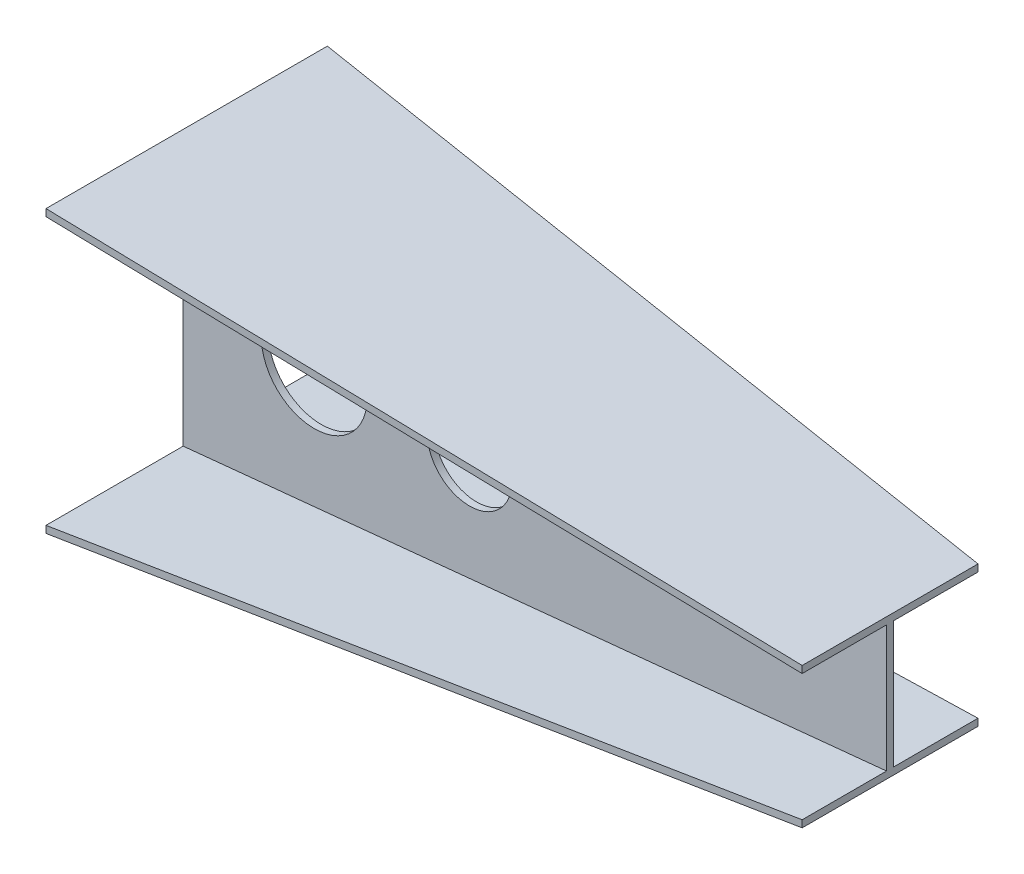
ISO-10303-21;
HEADER;
FILE_DESCRIPTION(('STEP AP214'),'2;1');
FILE_NAME('part.step','',(''),(''),'','','');
FILE_SCHEMA(('AUTOMOTIVE_DESIGN { 1 0 10303 214 1 1 1 1 }'));
ENDSEC;
DATA;
#1=APPLICATION_CONTEXT('core data for automotive mechanical design processes');
#2=APPLICATION_PROTOCOL_DEFINITION('international standard','automotive_design',2000,#1);
#3=PRODUCT_CONTEXT('',#1,'mechanical');
#4=PRODUCT('Part','Part','',(#3));
#5=PRODUCT_RELATED_PRODUCT_CATEGORY('part','',(#4));
#6=PRODUCT_DEFINITION_FORMATION('','',#4);
#7=PRODUCT_DEFINITION_CONTEXT('part definition',#1,'design');
#8=PRODUCT_DEFINITION('design','',#6,#7);
#9=PRODUCT_DEFINITION_SHAPE('','',#8);
#10=(LENGTH_UNIT() NAMED_UNIT(*) SI_UNIT(.MILLI.,.METRE.));
#11=(NAMED_UNIT(*) PLANE_ANGLE_UNIT() SI_UNIT($,.RADIAN.));
#12=(NAMED_UNIT(*) SI_UNIT($,.STERADIAN.) SOLID_ANGLE_UNIT());
#13=UNCERTAINTY_MEASURE_WITH_UNIT(LENGTH_MEASURE(1.E-05),#10,'distance_accuracy_value','');
#14=(GEOMETRIC_REPRESENTATION_CONTEXT(3) GLOBAL_UNCERTAINTY_ASSIGNED_CONTEXT((#13)) GLOBAL_UNIT_ASSIGNED_CONTEXT((#10,
#11,#12)) REPRESENTATION_CONTEXT('',''));
#15=CARTESIAN_POINT('',(0.,0.,0.));
#16=DIRECTION('',(0.,0.,1.));
#17=DIRECTION('',(1.,0.,0.));
#18=AXIS2_PLACEMENT_3D('',#15,#16,#17);
#19=CARTESIAN_POINT('',(1000.,0.,0.));
#20=DIRECTION('',(-1.,0.,0.));
#21=DIRECTION('',(0.,0.,1.));
#22=AXIS2_PLACEMENT_3D('',#19,#20,#21);
#23=PLANE('',#22);
#24=DIRECTION('',(0.,-1.,0.));
#25=VECTOR('',#24,1.);
#26=CARTESIAN_POINT('',(1000.,100.,-120.));
#27=LINE('',#26,#25);
#28=CARTESIAN_POINT('',(1000.,100.,-120.));
#29=VERTEX_POINT('',#28);
#30=CARTESIAN_POINT('',(1000.,90.,-120.));
#31=VERTEX_POINT('',#30);
#32=EDGE_CURVE('E384',#29,#31,#27,.T.);
#33=ORIENTED_EDGE('',*,*,#32,.F.);
#34=DIRECTION('',(0.,0.,-1.));
#35=VECTOR('',#34,1.);
#36=CARTESIAN_POINT('',(1000.,100.,-120.));
#37=LINE('',#36,#35);
#38=CARTESIAN_POINT('',(1000.,100.,130.));
#39=VERTEX_POINT('',#38);
#40=EDGE_CURVE('E12',#39,#29,#37,.T.);
#41=ORIENTED_EDGE('',*,*,#40,.F.);
#42=DIRECTION('',(0.,1.,0.));
#43=VECTOR('',#42,1.);
#44=CARTESIAN_POINT('',(1000.,100.,130.));
#45=LINE('',#44,#43);
#46=CARTESIAN_POINT('',(1000.,90.,130.));
#47=VERTEX_POINT('',#46);
#48=EDGE_CURVE('E73',#47,#39,#45,.T.);
#49=ORIENTED_EDGE('',*,*,#48,.F.);
#50=DIRECTION('',(0.,0.,1.));
#51=VECTOR('',#50,1.);
#52=CARTESIAN_POINT('',(1000.,90.,10.));
#53=LINE('',#52,#51);
#54=CARTESIAN_POINT('',(1000.,90.,10.));
#55=VERTEX_POINT('',#54);
#56=EDGE_CURVE('E660',#55,#47,#53,.T.);
#57=ORIENTED_EDGE('',*,*,#56,.F.);
#58=DIRECTION('',(0.,1.,0.));
#59=VECTOR('',#58,1.);
#60=CARTESIAN_POINT('',(1000.,90.,10.));
#61=LINE('',#60,#59);
#62=CARTESIAN_POINT('',(1000.,-90.,10.));
#63=VERTEX_POINT('',#62);
#64=EDGE_CURVE('E421',#63,#55,#61,.T.);
#65=ORIENTED_EDGE('',*,*,#64,.F.);
#66=DIRECTION('',(0.,0.,-1.));
#67=VECTOR('',#66,1.);
#68=CARTESIAN_POINT('',(1000.,-90.,10.));
#69=LINE('',#68,#67);
#70=CARTESIAN_POINT('',(1000.,-90.,130.));
#71=VERTEX_POINT('',#70);
#72=EDGE_CURVE('E435',#71,#63,#69,.T.);
#73=ORIENTED_EDGE('',*,*,#72,.F.);
#74=DIRECTION('',(0.,1.,0.));
#75=VECTOR('',#74,1.);
#76=CARTESIAN_POINT('',(1000.,-90.,130.));
#77=LINE('',#76,#75);
#78=CARTESIAN_POINT('',(1000.,-100.,130.));
#79=VERTEX_POINT('',#78);
#80=EDGE_CURVE('E449',#79,#71,#77,.T.);
#81=ORIENTED_EDGE('',*,*,#80,.F.);
#82=DIRECTION('',(0.,0.,1.));
#83=VECTOR('',#82,1.);
#84=CARTESIAN_POINT('',(1000.,-100.,-120.));
#85=LINE('',#84,#83);
#86=CARTESIAN_POINT('',(1000.,-100.,-120.));
#87=VERTEX_POINT('',#86);
#88=EDGE_CURVE('E631',#87,#79,#85,.T.);
#89=ORIENTED_EDGE('',*,*,#88,.F.);
#90=DIRECTION('',(0.,-1.,0.));
#91=VECTOR('',#90,1.);
#92=CARTESIAN_POINT('',(1000.,-90.,-120.));
#93=LINE('',#92,#91);
#94=CARTESIAN_POINT('',(1000.,-90.,-120.));
#95=VERTEX_POINT('',#94);
#96=EDGE_CURVE('E623',#95,#87,#93,.T.);
#97=ORIENTED_EDGE('',*,*,#96,.F.);
#98=DIRECTION('',(0.,0.,-1.));
#99=VECTOR('',#98,1.);
#100=CARTESIAN_POINT('',(1000.,-90.,-120.));
#101=LINE('',#100,#99);
#102=CARTESIAN_POINT('',(1000.,-90.,2.22044604925031E-13));
#103=VERTEX_POINT('',#102);
#104=EDGE_CURVE('E537',#103,#95,#101,.T.);
#105=ORIENTED_EDGE('',*,*,#104,.F.);
#106=DIRECTION('',(0.,-1.,0.));
#107=VECTOR('',#106,1.);
#108=CARTESIAN_POINT('',(1000.,90.,2.22044604925031E-13));
#109=LINE('',#108,#107);
#110=CARTESIAN_POINT('',(1000.,90.,2.22044604925031E-13));
#111=VERTEX_POINT('',#110);
#112=EDGE_CURVE('E87',#111,#103,#109,.T.);
#113=ORIENTED_EDGE('',*,*,#112,.F.);
#114=DIRECTION('',(0.,0.,1.));
#115=VECTOR('',#114,1.);
#116=CARTESIAN_POINT('',(1000.,90.,-120.));
#117=LINE('',#116,#115);
#118=EDGE_CURVE('E81',#31,#111,#117,.T.);
#119=ORIENTED_EDGE('',*,*,#118,.F.);
#120=EDGE_LOOP('',(#33,#41,#49,#57,#65,#73,#81,#89,#97,#105,#113,#119));
#121=FACE_BOUND('',#120,.T.);
#122=ADVANCED_FACE('F63',(#121),#23,.F.);
#123=CARTESIAN_POINT('',(0.,0.,0.));
#124=DIRECTION('',(1.,0.,0.));
#125=DIRECTION('',(0.,0.,-1.));
#126=AXIS2_PLACEMENT_3D('',#123,#124,#125);
#127=PLANE('',#126);
#128=DIRECTION('',(0.,-1.,0.));
#129=VECTOR('',#128,1.);
#130=CARTESIAN_POINT('',(0.,200.,205.));
#131=LINE('',#130,#129);
#132=CARTESIAN_POINT('',(0.,200.,205.));
#133=VERTEX_POINT('',#132);
#134=CARTESIAN_POINT('',(0.,190.,205.));
#135=VERTEX_POINT('',#134);
#136=EDGE_CURVE('E162',#133,#135,#131,.T.);
#137=ORIENTED_EDGE('',*,*,#136,.F.);
#138=DIRECTION('',(0.,0.,1.));
#139=VECTOR('',#138,1.);
#140=CARTESIAN_POINT('',(0.,200.,205.));
#141=LINE('',#140,#139);
#142=CARTESIAN_POINT('',(0.,200.,-195.));
#143=VERTEX_POINT('',#142);
#144=EDGE_CURVE('E171',#143,#133,#141,.T.);
#145=ORIENTED_EDGE('',*,*,#144,.F.);
#146=DIRECTION('',(0.,1.,0.));
#147=VECTOR('',#146,1.);
#148=CARTESIAN_POINT('',(0.,200.,-195.));
#149=LINE('',#148,#147);
#150=CARTESIAN_POINT('',(0.,190.,-195.));
#151=VERTEX_POINT('',#150);
#152=EDGE_CURVE('E178',#151,#143,#149,.T.);
#153=ORIENTED_EDGE('',*,*,#152,.F.);
#154=DIRECTION('',(0.,0.,-1.));
#155=VECTOR('',#154,1.);
#156=CARTESIAN_POINT('',(0.,190.,0.));
#157=LINE('',#156,#155);
#158=CARTESIAN_POINT('',(0.,190.,0.));
#159=VERTEX_POINT('',#158);
#160=EDGE_CURVE('E307',#159,#151,#157,.T.);
#161=ORIENTED_EDGE('',*,*,#160,.F.);
#162=DIRECTION('',(0.,1.,0.));
#163=VECTOR('',#162,1.);
#164=CARTESIAN_POINT('',(0.,190.,0.));
#165=LINE('',#164,#163);
#166=CARTESIAN_POINT('',(0.,-190.,0.));
#167=VERTEX_POINT('',#166);
#168=EDGE_CURVE('E303',#167,#159,#165,.T.);
#169=ORIENTED_EDGE('',*,*,#168,.F.);
#170=DIRECTION('',(0.,0.,1.));
#171=VECTOR('',#170,1.);
#172=CARTESIAN_POINT('',(0.,-190.,0.));
#173=LINE('',#172,#171);
#174=CARTESIAN_POINT('',(0.,-190.,-195.));
#175=VERTEX_POINT('',#174);
#176=EDGE_CURVE('E299',#175,#167,#173,.T.);
#177=ORIENTED_EDGE('',*,*,#176,.F.);
#178=DIRECTION('',(0.,1.,0.));
#179=VECTOR('',#178,1.);
#180=CARTESIAN_POINT('',(0.,-190.,-195.));
#181=LINE('',#180,#179);
#182=CARTESIAN_POINT('',(0.,-200.,-195.));
#183=VERTEX_POINT('',#182);
#184=EDGE_CURVE('E295',#183,#175,#181,.T.);
#185=ORIENTED_EDGE('',*,*,#184,.F.);
#186=DIRECTION('',(0.,0.,-1.));
#187=VECTOR('',#186,1.);
#188=CARTESIAN_POINT('',(0.,-200.,205.));
#189=LINE('',#188,#187);
#190=CARTESIAN_POINT('',(0.,-200.,205.));
#191=VERTEX_POINT('',#190);
#192=EDGE_CURVE('E291',#191,#183,#189,.T.);
#193=ORIENTED_EDGE('',*,*,#192,.F.);
#194=DIRECTION('',(0.,-1.,0.));
#195=VECTOR('',#194,1.);
#196=CARTESIAN_POINT('',(0.,-190.,205.));
#197=LINE('',#196,#195);
#198=CARTESIAN_POINT('',(0.,-190.,205.));
#199=VERTEX_POINT('',#198);
#200=EDGE_CURVE('E287',#199,#191,#197,.T.);
#201=ORIENTED_EDGE('',*,*,#200,.F.);
#202=DIRECTION('',(0.,0.,1.));
#203=VECTOR('',#202,1.);
#204=CARTESIAN_POINT('',(0.,-190.,205.));
#205=LINE('',#204,#203);
#206=CARTESIAN_POINT('',(0.,-190.,10.0000000000001));
#207=VERTEX_POINT('',#206);
#208=EDGE_CURVE('E282',#207,#199,#205,.T.);
#209=ORIENTED_EDGE('',*,*,#208,.F.);
#210=DIRECTION('',(0.,-1.,0.));
#211=VECTOR('',#210,1.);
#212=CARTESIAN_POINT('',(0.,190.,10.0000000000001));
#213=LINE('',#212,#211);
#214=CARTESIAN_POINT('',(0.,190.,10.0000000000001));
#215=VERTEX_POINT('',#214);
#216=EDGE_CURVE('E280',#215,#207,#213,.T.);
#217=ORIENTED_EDGE('',*,*,#216,.F.);
#218=DIRECTION('',(0.,0.,-1.));
#219=VECTOR('',#218,1.);
#220=CARTESIAN_POINT('',(0.,190.,205.));
#221=LINE('',#220,#219);
#222=EDGE_CURVE('E185',#135,#215,#221,.T.);
#223=ORIENTED_EDGE('',*,*,#222,.F.);
#224=EDGE_LOOP('',(#137,#145,#153,#161,#169,#177,#185,#193,#201,#209,#217,#223));
#225=FACE_BOUND('',#224,.T.);
#226=ADVANCED_FACE('F183',(#225),#127,.F.);
#227=CARTESIAN_POINT('',(0.,0.,10.0000000000001));
#228=DIRECTION('',(0.,0.,1.));
#229=DIRECTION('',(1.,0.,0.));
#230=AXIS2_PLACEMENT_3D('',#227,#228,#229);
#231=PLANE('',#230);
#232=CARTESIAN_POINT('',(186.377200583415,0.,10.0000000000001));
#233=DIRECTION('',(0.,0.,1.));
#234=DIRECTION('',(1.,0.,0.));
#235=AXIS2_PLACEMENT_3D('',#232,#233,#234);
#236=CIRCLE('',#235,75.2451149630239);
#237=CARTESIAN_POINT('',(261.622315546439,0.,10.0000000000001));
#238=VERTEX_POINT('',#237);
#239=EDGE_CURVE('E808',#238,#238,#236,.T.);
#240=ORIENTED_EDGE('',*,*,#239,.F.);
#241=EDGE_LOOP('',(#240));
#242=FACE_BOUND('',#241,.T.);
#243=CARTESIAN_POINT('',(407.046905619119,0.,10.0000000000001));
#244=DIRECTION('',(0.,0.,1.));
#245=DIRECTION('',(1.,0.,0.));
#246=AXIS2_PLACEMENT_3D('',#243,#244,#245);
#247=CIRCLE('',#246,60.1764664420333);
#248=CARTESIAN_POINT('',(467.223372061152,0.,10.0000000000001));
#249=VERTEX_POINT('',#248);
#250=EDGE_CURVE('E813',#249,#249,#247,.T.);
#251=ORIENTED_EDGE('',*,*,#250,.F.);
#252=EDGE_LOOP('',(#251));
#253=FACE_BOUND('',#252,.T.);
#254=DIRECTION('',(0.995037190209989,0.0995037190209989,0.));
#255=VECTOR('',#254,1.);
#256=CARTESIAN_POINT('',(0.,-190.,10.0000000000001));
#257=LINE('',#256,#255);
#258=EDGE_CURVE('E177',#207,#63,#257,.T.);
#259=ORIENTED_EDGE('',*,*,#258,.T.);
#260=ORIENTED_EDGE('',*,*,#64,.T.);
#261=DIRECTION('',(0.995037190209989,-0.0995037190209989,0.));
#262=VECTOR('',#261,1.);
#263=CARTESIAN_POINT('',(0.,190.,10.0000000000001));
#264=LINE('',#263,#262);
#265=EDGE_CURVE('E394',#215,#55,#264,.T.);
#266=ORIENTED_EDGE('',*,*,#265,.F.);
#267=ORIENTED_EDGE('',*,*,#216,.T.);
#268=EDGE_LOOP('',(#259,#260,#266,#267));
#269=FACE_BOUND('',#268,.T.);
#270=ADVANCED_FACE('F208',(#242,#253,#269),#231,.T.);
#271=CARTESIAN_POINT('',(18.8118811881188,188.118811881188,0.));
#272=DIRECTION('',(-0.0995037190209989,-0.995037190209989,0.));
#273=DIRECTION('',(0.995037190209989,-0.0995037190209989,0.));
#274=AXIS2_PLACEMENT_3D('',#271,#272,#273);
#275=PLANE('',#274);
#276=ORIENTED_EDGE('',*,*,#265,.T.);
#277=ORIENTED_EDGE('',*,*,#56,.T.);
#278=DIRECTION('',(0.992277876713668,-0.0992277876713667,-0.074420840753525));
#279=VECTOR('',#278,1.);
#280=CARTESIAN_POINT('',(0.,190.,205.));
#281=LINE('',#280,#279);
#282=EDGE_CURVE('E167',#135,#47,#281,.T.);
#283=ORIENTED_EDGE('',*,*,#282,.F.);
#284=ORIENTED_EDGE('',*,*,#222,.T.);
#285=EDGE_LOOP('',(#276,#277,#283,#284));
#286=FACE_BOUND('',#285,.T.);
#287=ADVANCED_FACE('F396',(#286),#275,.T.);
#288=CARTESIAN_POINT('',(18.8118811881188,-188.118811881188,0.));
#289=DIRECTION('',(-0.099503719020999,0.995037190209989,0.));
#290=DIRECTION('',(-0.995037190209989,-0.099503719020999,0.));
#291=AXIS2_PLACEMENT_3D('',#288,#289,#290);
#292=PLANE('',#291);
#293=DIRECTION('',(0.992277876713668,0.0992277876713669,-0.074420840753525));
#294=VECTOR('',#293,1.);
#295=CARTESIAN_POINT('',(0.,-190.,205.));
#296=LINE('',#295,#294);
#297=EDGE_CURVE('E482',#199,#71,#296,.T.);
#298=ORIENTED_EDGE('',*,*,#297,.T.);
#299=ORIENTED_EDGE('',*,*,#72,.T.);
#300=ORIENTED_EDGE('',*,*,#258,.F.);
#301=ORIENTED_EDGE('',*,*,#208,.T.);
#302=EDGE_LOOP('',(#298,#299,#300,#301));
#303=FACE_BOUND('',#302,.T.);
#304=ADVANCED_FACE('F405',(#303),#292,.T.);
#305=CARTESIAN_POINT('',(15.2889993784959,0.,203.853325046613));
#306=DIRECTION('',(0.0747899482416341,0.,0.997199309888456));
#307=DIRECTION('',(0.997199309888457,0.,-0.0747899482416341));
#308=AXIS2_PLACEMENT_3D('',#305,#306,#307);
#309=PLANE('',#308);
#310=DIRECTION('',(0.992277876713668,0.0992277876713669,-0.074420840753525));
#311=VECTOR('',#310,1.);
#312=CARTESIAN_POINT('',(0.,-200.,205.));
#313=LINE('',#312,#311);
#314=EDGE_CURVE('E474',#191,#79,#313,.T.);
#315=ORIENTED_EDGE('',*,*,#314,.T.);
#316=ORIENTED_EDGE('',*,*,#80,.T.);
#317=ORIENTED_EDGE('',*,*,#297,.F.);
#318=ORIENTED_EDGE('',*,*,#200,.T.);
#319=EDGE_LOOP('',(#315,#316,#317,#318));
#320=FACE_BOUND('',#319,.T.);
#321=ADVANCED_FACE('F455',(#320),#309,.T.);
#322=CARTESIAN_POINT('',(19.8019801980198,-198.019801980198,0.));
#323=DIRECTION('',(0.0995037190209989,-0.995037190209989,0.));
#324=DIRECTION('',(0.995037190209989,0.0995037190209989,0.));
#325=AXIS2_PLACEMENT_3D('',#322,#323,#324);
#326=PLANE('',#325);
#327=DIRECTION('',(0.992277876713668,0.0992277876713668,0.0744208407535252));
#328=VECTOR('',#327,1.);
#329=CARTESIAN_POINT('',(0.,-200.,-195.));
#330=LINE('',#329,#328);
#331=EDGE_CURVE('E481',#183,#87,#330,.T.);
#332=ORIENTED_EDGE('',*,*,#331,.T.);
#333=ORIENTED_EDGE('',*,*,#88,.T.);
#334=ORIENTED_EDGE('',*,*,#314,.F.);
#335=ORIENTED_EDGE('',*,*,#192,.T.);
#336=EDGE_LOOP('',(#332,#333,#334,#335));
#337=FACE_BOUND('',#336,.T.);
#338=ADVANCED_FACE('F464',(#337),#326,.T.);
#339=CARTESIAN_POINT('',(14.5431945307645,0.,-193.909260410193));
#340=DIRECTION('',(0.0747899482416343,0.,-0.997199309888456));
#341=DIRECTION('',(-0.997199309888457,0.,-0.0747899482416344));
#342=AXIS2_PLACEMENT_3D('',#339,#340,#341);
#343=PLANE('',#342);
#344=DIRECTION('',(0.992277876713668,0.0992277876713668,0.0744208407535252));
#345=VECTOR('',#344,1.);
#346=CARTESIAN_POINT('',(0.,-190.,-195.));
#347=LINE('',#346,#345);
#348=EDGE_CURVE('E499',#175,#95,#347,.T.);
#349=ORIENTED_EDGE('',*,*,#348,.T.);
#350=ORIENTED_EDGE('',*,*,#96,.T.);
#351=ORIENTED_EDGE('',*,*,#331,.F.);
#352=ORIENTED_EDGE('',*,*,#184,.T.);
#353=EDGE_LOOP('',(#349,#350,#351,#352));
#354=FACE_BOUND('',#353,.T.);
#355=ADVANCED_FACE('F510',(#354),#343,.T.);
#356=CARTESIAN_POINT('',(18.8118811881188,-188.118811881188,0.));
#357=DIRECTION('',(-0.0995037190209989,0.995037190209989,0.));
#358=DIRECTION('',(-0.995037190209989,-0.0995037190209989,0.));
#359=AXIS2_PLACEMENT_3D('',#356,#357,#358);
#360=PLANE('',#359);
#361=DIRECTION('',(0.995037190209989,0.0995037190209989,0.));
#362=VECTOR('',#361,1.);
#363=CARTESIAN_POINT('',(0.,-190.,0.));
#364=LINE('',#363,#362);
#365=EDGE_CURVE('E577',#167,#103,#364,.T.);
#366=ORIENTED_EDGE('',*,*,#365,.T.);
#367=ORIENTED_EDGE('',*,*,#104,.T.);
#368=ORIENTED_EDGE('',*,*,#348,.F.);
#369=ORIENTED_EDGE('',*,*,#176,.T.);
#370=EDGE_LOOP('',(#366,#367,#368,#369));
#371=FACE_BOUND('',#370,.T.);
#372=ADVANCED_FACE('F519',(#371),#360,.T.);
#373=CARTESIAN_POINT('',(0.,0.,0.));
#374=DIRECTION('',(0.,0.,-1.));
#375=DIRECTION('',(-1.,0.,0.));
#376=AXIS2_PLACEMENT_3D('',#373,#374,#375);
#377=PLANE('',#376);
#378=CARTESIAN_POINT('',(186.377200583415,0.,0.));
#379=DIRECTION('',(0.,0.,1.));
#380=DIRECTION('',(1.,0.,0.));
#381=AXIS2_PLACEMENT_3D('',#378,#379,#380);
#382=CIRCLE('',#381,75.2451149630239);
#383=CARTESIAN_POINT('',(261.622315546439,0.,0.));
#384=VERTEX_POINT('',#383);
#385=EDGE_CURVE('E187',#384,#384,#382,.T.);
#386=ORIENTED_EDGE('',*,*,#385,.T.);
#387=EDGE_LOOP('',(#386));
#388=FACE_BOUND('',#387,.T.);
#389=CARTESIAN_POINT('',(407.046905619119,0.,0.));
#390=DIRECTION('',(0.,0.,1.));
#391=DIRECTION('',(1.,0.,0.));
#392=AXIS2_PLACEMENT_3D('',#389,#390,#391);
#393=CIRCLE('',#392,60.1764664420333);
#394=CARTESIAN_POINT('',(467.223372061152,0.,0.));
#395=VERTEX_POINT('',#394);
#396=EDGE_CURVE('E809',#395,#395,#393,.T.);
#397=ORIENTED_EDGE('',*,*,#396,.T.);
#398=EDGE_LOOP('',(#397));
#399=FACE_BOUND('',#398,.T.);
#400=DIRECTION('',(0.995037190209989,-0.0995037190209989,0.));
#401=VECTOR('',#400,1.);
#402=CARTESIAN_POINT('',(0.,190.,0.));
#403=LINE('',#402,#401);
#404=EDGE_CURVE('E569',#159,#111,#403,.T.);
#405=ORIENTED_EDGE('',*,*,#404,.T.);
#406=ORIENTED_EDGE('',*,*,#112,.T.);
#407=ORIENTED_EDGE('',*,*,#365,.F.);
#408=ORIENTED_EDGE('',*,*,#168,.T.);
#409=EDGE_LOOP('',(#405,#406,#407,#408));
#410=FACE_BOUND('',#409,.T.);
#411=ADVANCED_FACE('F553',(#388,#399,#410),#377,.T.);
#412=CARTESIAN_POINT('',(18.8118811881188,188.118811881188,0.));
#413=DIRECTION('',(-0.0995037190209989,-0.995037190209989,0.));
#414=DIRECTION('',(0.995037190209989,-0.0995037190209989,0.));
#415=AXIS2_PLACEMENT_3D('',#412,#413,#414);
#416=PLANE('',#415);
#417=DIRECTION('',(0.992277876713668,-0.0992277876713668,0.0744208407535251));
#418=VECTOR('',#417,1.);
#419=CARTESIAN_POINT('',(0.,190.,-195.));
#420=LINE('',#419,#418);
#421=EDGE_CURVE('E576',#151,#31,#420,.T.);
#422=ORIENTED_EDGE('',*,*,#421,.T.);
#423=ORIENTED_EDGE('',*,*,#118,.T.);
#424=ORIENTED_EDGE('',*,*,#404,.F.);
#425=ORIENTED_EDGE('',*,*,#160,.T.);
#426=EDGE_LOOP('',(#422,#423,#424,#425));
#427=FACE_BOUND('',#426,.T.);
#428=ADVANCED_FACE('F334',(#427),#416,.T.);
#429=CARTESIAN_POINT('',(14.5431945307644,0.,-193.909260410193));
#430=DIRECTION('',(0.0747899482416343,0.,-0.997199309888456));
#431=DIRECTION('',(-0.997199309888457,0.,-0.0747899482416343));
#432=AXIS2_PLACEMENT_3D('',#429,#430,#431);
#433=PLANE('',#432);
#434=DIRECTION('',(0.992277876713668,-0.0992277876713668,0.0744208407535251));
#435=VECTOR('',#434,1.);
#436=CARTESIAN_POINT('',(0.,200.,-195.));
#437=LINE('',#436,#435);
#438=EDGE_CURVE('E168',#143,#29,#437,.T.);
#439=ORIENTED_EDGE('',*,*,#438,.T.);
#440=ORIENTED_EDGE('',*,*,#32,.T.);
#441=ORIENTED_EDGE('',*,*,#421,.F.);
#442=ORIENTED_EDGE('',*,*,#152,.T.);
#443=EDGE_LOOP('',(#439,#440,#441,#442));
#444=FACE_BOUND('',#443,.T.);
#445=ADVANCED_FACE('F324',(#444),#433,.T.);
#446=CARTESIAN_POINT('',(19.8019801980198,198.019801980198,0.));
#447=DIRECTION('',(0.0995037190209988,0.995037190209989,0.));
#448=DIRECTION('',(-0.995037190209989,0.0995037190209988,0.));
#449=AXIS2_PLACEMENT_3D('',#446,#447,#448);
#450=PLANE('',#449);
#451=DIRECTION('',(0.992277876713668,-0.0992277876713667,-0.0744208407535251));
#452=VECTOR('',#451,1.);
#453=CARTESIAN_POINT('',(0.,200.,205.));
#454=LINE('',#453,#452);
#455=EDGE_CURVE('E157',#133,#39,#454,.T.);
#456=ORIENTED_EDGE('',*,*,#455,.T.);
#457=ORIENTED_EDGE('',*,*,#40,.T.);
#458=ORIENTED_EDGE('',*,*,#438,.F.);
#459=ORIENTED_EDGE('',*,*,#144,.T.);
#460=EDGE_LOOP('',(#456,#457,#458,#459));
#461=FACE_BOUND('',#460,.T.);
#462=ADVANCED_FACE('F173',(#461),#450,.T.);
#463=CARTESIAN_POINT('',(15.288999378496,0.,203.853325046613));
#464=DIRECTION('',(0.0747899482416342,0.,0.997199309888456));
#465=DIRECTION('',(0.997199309888457,0.,-0.0747899482416342));
#466=AXIS2_PLACEMENT_3D('',#463,#464,#465);
#467=PLANE('',#466);
#468=ORIENTED_EDGE('',*,*,#282,.T.);
#469=ORIENTED_EDGE('',*,*,#48,.T.);
#470=ORIENTED_EDGE('',*,*,#455,.F.);
#471=ORIENTED_EDGE('',*,*,#136,.T.);
#472=EDGE_LOOP('',(#468,#469,#470,#471));
#473=FACE_BOUND('',#472,.T.);
#474=ADVANCED_FACE('F160',(#473),#467,.T.);
#475=CARTESIAN_POINT('',(407.046905619119,0.,0.));
#476=DIRECTION('',(0.,0.,1.));
#477=DIRECTION('',(1.,0.,0.));
#478=AXIS2_PLACEMENT_3D('',#475,#476,#477);
#479=CYLINDRICAL_SURFACE('',#478,60.1764664420333);
#480=ORIENTED_EDGE('',*,*,#396,.F.);
#481=EDGE_LOOP('',(#480));
#482=FACE_BOUND('',#481,.T.);
#483=ORIENTED_EDGE('',*,*,#250,.T.);
#484=EDGE_LOOP('',(#483));
#485=FACE_BOUND('',#484,.T.);
#486=ADVANCED_FACE('F209',(#482,#485),#479,.F.);
#487=CARTESIAN_POINT('',(186.377200583415,0.,0.));
#488=DIRECTION('',(0.,0.,1.));
#489=DIRECTION('',(1.,0.,0.));
#490=AXIS2_PLACEMENT_3D('',#487,#488,#489);
#491=CYLINDRICAL_SURFACE('',#490,75.2451149630239);
#492=ORIENTED_EDGE('',*,*,#385,.F.);
#493=EDGE_LOOP('',(#492));
#494=FACE_BOUND('',#493,.T.);
#495=ORIENTED_EDGE('',*,*,#239,.T.);
#496=EDGE_LOOP('',(#495));
#497=FACE_BOUND('',#496,.T.);
#498=ADVANCED_FACE('F791',(#494,#497),#491,.F.);
#499=CLOSED_SHELL('',(#122,#226,#270,#287,#304,#321,#338,#355,#372,#411,#428,#445,#462,#474,
#486,#498));
#500=MANIFOLD_SOLID_BREP('B2',#499);
#501=ADVANCED_BREP_SHAPE_REPRESENTATION('',(#18,#500),#14);
#502=SHAPE_DEFINITION_REPRESENTATION(#9,#501);
ENDSEC;
END-ISO-10303-21;
